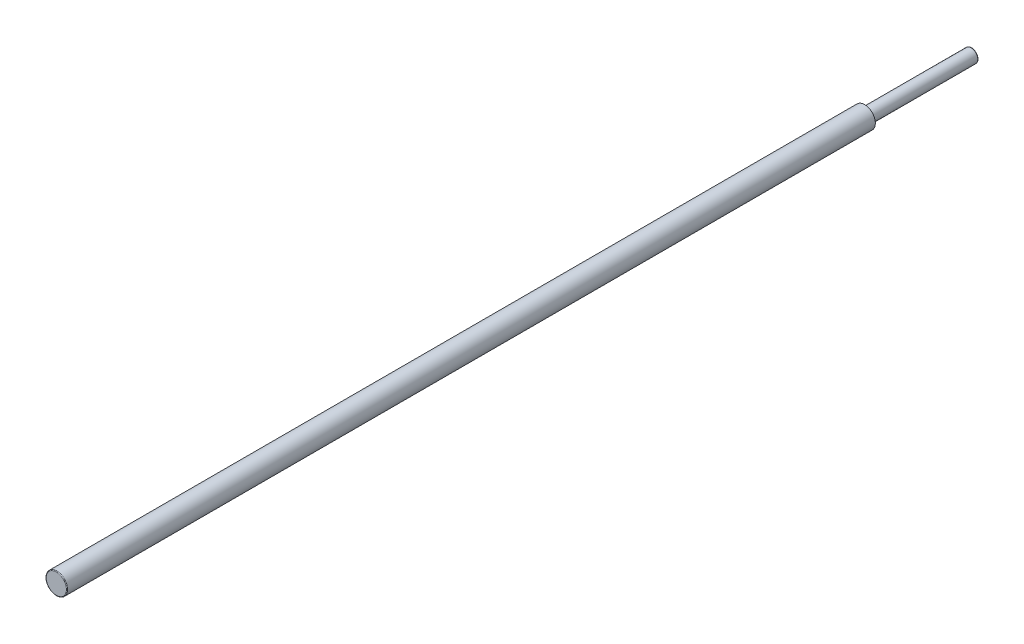
ISO-10303-21;
HEADER;
FILE_DESCRIPTION(('STEP AP214'),'2;1');
FILE_NAME('part.step','',(''),(''),'','','');
FILE_SCHEMA(('AUTOMOTIVE_DESIGN { 1 0 10303 214 1 1 1 1 }'));
ENDSEC;
DATA;
#1=APPLICATION_CONTEXT('core data for automotive mechanical design processes');
#2=APPLICATION_PROTOCOL_DEFINITION('international standard','automotive_design',2000,#1);
#3=PRODUCT_CONTEXT('',#1,'mechanical');
#4=PRODUCT('Part','Part','',(#3));
#5=PRODUCT_RELATED_PRODUCT_CATEGORY('part','',(#4));
#6=PRODUCT_DEFINITION_FORMATION('','',#4);
#7=PRODUCT_DEFINITION_CONTEXT('part definition',#1,'design');
#8=PRODUCT_DEFINITION('design','',#6,#7);
#9=PRODUCT_DEFINITION_SHAPE('','',#8);
#10=(LENGTH_UNIT() NAMED_UNIT(*) SI_UNIT(.MILLI.,.METRE.));
#11=(NAMED_UNIT(*) PLANE_ANGLE_UNIT() SI_UNIT($,.RADIAN.));
#12=(NAMED_UNIT(*) SI_UNIT($,.STERADIAN.) SOLID_ANGLE_UNIT());
#13=UNCERTAINTY_MEASURE_WITH_UNIT(LENGTH_MEASURE(1.E-05),#10,'distance_accuracy_value','');
#14=(GEOMETRIC_REPRESENTATION_CONTEXT(3) GLOBAL_UNCERTAINTY_ASSIGNED_CONTEXT((#13)) GLOBAL_UNIT_ASSIGNED_CONTEXT((#10,
#11,#12)) REPRESENTATION_CONTEXT('',''));
#15=CARTESIAN_POINT('',(0.,0.,0.));
#16=DIRECTION('',(0.,0.,1.));
#17=DIRECTION('',(1.,0.,0.));
#18=AXIS2_PLACEMENT_3D('',#15,#16,#17);
#19=CARTESIAN_POINT('',(0.,0.,40.));
#20=DIRECTION('',(0.,0.,-1.));
#21=DIRECTION('',(-1.,0.,0.));
#22=AXIS2_PLACEMENT_3D('',#19,#20,#21);
#23=CYLINDRICAL_SURFACE('',#22,2.5);
#24=CARTESIAN_POINT('',(0.,0.,0.25));
#25=DIRECTION('',(0.,0.,1.));
#26=DIRECTION('',(1.,0.,0.));
#27=AXIS2_PLACEMENT_3D('',#24,#25,#26);
#28=CIRCLE('',#27,2.5);
#29=CARTESIAN_POINT('',(2.5,0.,0.25));
#30=VERTEX_POINT('',#29);
#31=EDGE_CURVE('E39',#30,#30,#28,.T.);
#32=ORIENTED_EDGE('',*,*,#31,.T.);
#33=EDGE_LOOP('',(#32));
#34=FACE_BOUND('',#33,.T.);
#35=CARTESIAN_POINT('',(0.,0.,40.));
#36=DIRECTION('',(0.,0.,1.));
#37=DIRECTION('',(1.,0.,0.));
#38=AXIS2_PLACEMENT_3D('',#35,#36,#37);
#39=CIRCLE('',#38,2.5);
#40=CARTESIAN_POINT('',(2.5,0.,40.));
#41=VERTEX_POINT('',#40);
#42=EDGE_CURVE('E52',#41,#41,#39,.T.);
#43=ORIENTED_EDGE('',*,*,#42,.F.);
#44=EDGE_LOOP('',(#43));
#45=FACE_BOUND('',#44,.T.);
#46=ADVANCED_FACE('F32',(#34,#45),#23,.T.);
#47=CARTESIAN_POINT('',(0.,0.,0.));
#48=DIRECTION('',(0.,0.,1.));
#49=DIRECTION('',(1.,0.,0.));
#50=AXIS2_PLACEMENT_3D('',#47,#48,#49);
#51=PLANE('',#50);
#52=CARTESIAN_POINT('',(0.,0.,0.));
#53=DIRECTION('',(0.,0.,1.));
#54=DIRECTION('',(1.,0.,0.));
#55=AXIS2_PLACEMENT_3D('',#52,#53,#54);
#56=CIRCLE('',#55,2.25);
#57=CARTESIAN_POINT('',(2.25,0.,0.));
#58=VERTEX_POINT('',#57);
#59=EDGE_CURVE('E10',#58,#58,#56,.F.);
#60=ORIENTED_EDGE('',*,*,#59,.T.);
#61=EDGE_LOOP('',(#60));
#62=FACE_BOUND('',#61,.T.);
#63=ADVANCED_FACE('F64',(#62),#51,.F.);
#64=CARTESIAN_POINT('',(0.,0.,40.));
#65=DIRECTION('',(0.,0.,1.));
#66=DIRECTION('',(1.,0.,0.));
#67=AXIS2_PLACEMENT_3D('',#64,#65,#66);
#68=PLANE('',#67);
#69=CARTESIAN_POINT('',(0.,0.,40.));
#70=DIRECTION('',(0.,0.,1.));
#71=DIRECTION('',(1.,0.,0.));
#72=AXIS2_PLACEMENT_3D('',#69,#70,#71);
#73=CIRCLE('',#72,4.);
#74=CARTESIAN_POINT('',(4.,0.,40.));
#75=VERTEX_POINT('',#74);
#76=EDGE_CURVE('E55',#75,#75,#73,.T.);
#77=ORIENTED_EDGE('',*,*,#76,.F.);
#78=EDGE_LOOP('',(#77));
#79=FACE_BOUND('',#78,.T.);
#80=ORIENTED_EDGE('',*,*,#42,.T.);
#81=EDGE_LOOP('',(#80));
#82=FACE_BOUND('',#81,.T.);
#83=ADVANCED_FACE('F61',(#79,#82),#68,.F.);
#84=CARTESIAN_POINT('',(0.,0.,342.));
#85=DIRECTION('',(0.,0.,-1.));
#86=DIRECTION('',(-1.,0.,0.));
#87=AXIS2_PLACEMENT_3D('',#84,#85,#86);
#88=CYLINDRICAL_SURFACE('',#87,4.);
#89=CARTESIAN_POINT('',(0.,0.,341.75));
#90=DIRECTION('',(0.,0.,1.));
#91=DIRECTION('',(1.,0.,0.));
#92=AXIS2_PLACEMENT_3D('',#89,#90,#91);
#93=CIRCLE('',#92,4.);
#94=CARTESIAN_POINT('',(4.,0.,341.75));
#95=VERTEX_POINT('',#94);
#96=EDGE_CURVE('E43',#95,#95,#93,.F.);
#97=ORIENTED_EDGE('',*,*,#96,.T.);
#98=EDGE_LOOP('',(#97));
#99=FACE_BOUND('',#98,.T.);
#100=ORIENTED_EDGE('',*,*,#76,.T.);
#101=EDGE_LOOP('',(#100));
#102=FACE_BOUND('',#101,.T.);
#103=ADVANCED_FACE('F59',(#99,#102),#88,.T.);
#104=CARTESIAN_POINT('',(0.,0.,342.));
#105=DIRECTION('',(0.,0.,1.));
#106=DIRECTION('',(1.,0.,0.));
#107=AXIS2_PLACEMENT_3D('',#104,#105,#106);
#108=PLANE('',#107);
#109=CARTESIAN_POINT('',(0.,0.,342.));
#110=DIRECTION('',(0.,0.,1.));
#111=DIRECTION('',(1.,0.,0.));
#112=AXIS2_PLACEMENT_3D('',#109,#110,#111);
#113=CIRCLE('',#112,3.75);
#114=CARTESIAN_POINT('',(3.75,0.,342.));
#115=VERTEX_POINT('',#114);
#116=EDGE_CURVE('E47',#115,#115,#113,.T.);
#117=ORIENTED_EDGE('',*,*,#116,.T.);
#118=EDGE_LOOP('',(#117));
#119=FACE_BOUND('',#118,.T.);
#120=ADVANCED_FACE('F77',(#119),#108,.T.);
#121=CARTESIAN_POINT('',(0.,0.,341.75));
#122=DIRECTION('',(0.,0.,1.));
#123=DIRECTION('',(1.,0.,0.));
#124=AXIS2_PLACEMENT_3D('',#121,#122,#123);
#125=TOROIDAL_SURFACE('',#124,3.75,0.25);
#126=ORIENTED_EDGE('',*,*,#96,.F.);
#127=EDGE_LOOP('',(#126));
#128=FACE_BOUND('',#127,.T.);
#129=ORIENTED_EDGE('',*,*,#116,.F.);
#130=EDGE_LOOP('',(#129));
#131=FACE_BOUND('',#130,.T.);
#132=ADVANCED_FACE('F75',(#128,#131),#125,.T.);
#133=CARTESIAN_POINT('',(0.,0.,0.25));
#134=DIRECTION('',(0.,0.,1.));
#135=DIRECTION('',(1.,0.,0.));
#136=AXIS2_PLACEMENT_3D('',#133,#134,#135);
#137=TOROIDAL_SURFACE('',#136,2.25,0.25);
#138=ORIENTED_EDGE('',*,*,#59,.F.);
#139=EDGE_LOOP('',(#138));
#140=FACE_BOUND('',#139,.T.);
#141=ORIENTED_EDGE('',*,*,#31,.F.);
#142=EDGE_LOOP('',(#141));
#143=FACE_BOUND('',#142,.T.);
#144=ADVANCED_FACE('F34',(#140,#143),#137,.T.);
#145=CLOSED_SHELL('',(#46,#63,#83,#103,#120,#132,#144));
#146=MANIFOLD_SOLID_BREP('B2',#145);
#147=ADVANCED_BREP_SHAPE_REPRESENTATION('',(#18,#146),#14);
#148=SHAPE_DEFINITION_REPRESENTATION(#9,#147);
ENDSEC;
END-ISO-10303-21;
